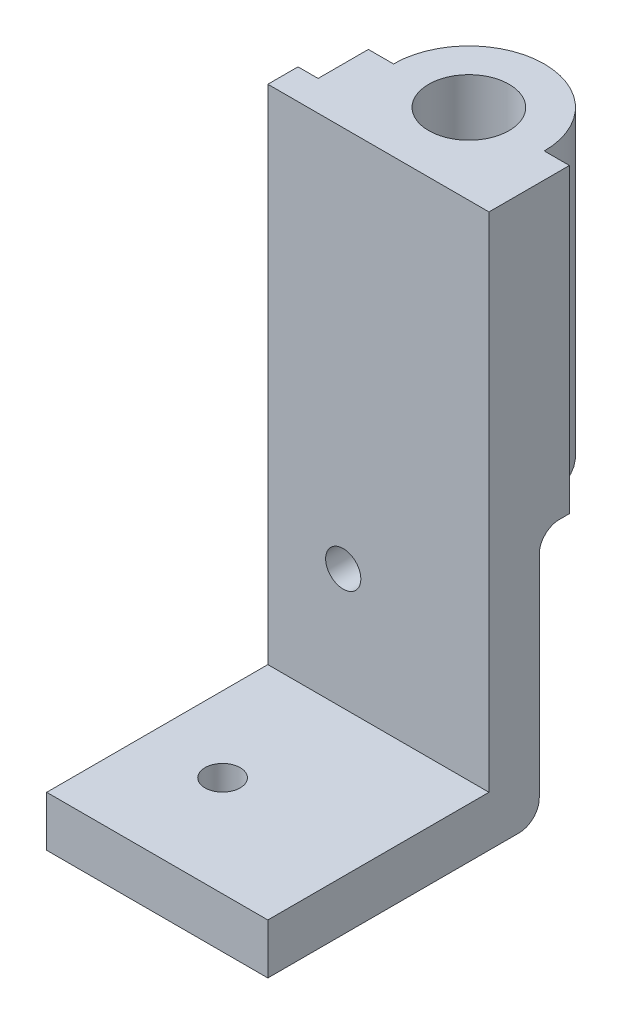
ISO-10303-21;
HEADER;
FILE_DESCRIPTION(('STEP AP214'),'2;1');
FILE_NAME('part.step','',(''),(''),'','','');
FILE_SCHEMA(('AUTOMOTIVE_DESIGN { 1 0 10303 214 1 1 1 1 }'));
ENDSEC;
DATA;
#1=APPLICATION_CONTEXT('core data for automotive mechanical design processes');
#2=APPLICATION_PROTOCOL_DEFINITION('international standard','automotive_design',2000,#1);
#3=PRODUCT_CONTEXT('',#1,'mechanical');
#4=PRODUCT('Part','Part','',(#3));
#5=PRODUCT_RELATED_PRODUCT_CATEGORY('part','',(#4));
#6=PRODUCT_DEFINITION_FORMATION('','',#4);
#7=PRODUCT_DEFINITION_CONTEXT('part definition',#1,'design');
#8=PRODUCT_DEFINITION('design','',#6,#7);
#9=PRODUCT_DEFINITION_SHAPE('','',#8);
#10=(LENGTH_UNIT() NAMED_UNIT(*) SI_UNIT(.MILLI.,.METRE.));
#11=(NAMED_UNIT(*) PLANE_ANGLE_UNIT() SI_UNIT($,.RADIAN.));
#12=(NAMED_UNIT(*) SI_UNIT($,.STERADIAN.) SOLID_ANGLE_UNIT());
#13=UNCERTAINTY_MEASURE_WITH_UNIT(LENGTH_MEASURE(1.E-05),#10,'distance_accuracy_value','');
#14=(GEOMETRIC_REPRESENTATION_CONTEXT(3) GLOBAL_UNCERTAINTY_ASSIGNED_CONTEXT((#13)) GLOBAL_UNIT_ASSIGNED_CONTEXT((#10,
#11,#12)) REPRESENTATION_CONTEXT('',''));
#15=CARTESIAN_POINT('',(0.,0.,0.));
#16=DIRECTION('',(0.,0.,1.));
#17=DIRECTION('',(1.,0.,0.));
#18=AXIS2_PLACEMENT_3D('',#15,#16,#17);
#19=CARTESIAN_POINT('',(0.,0.,0.));
#20=DIRECTION('',(0.,0.,-1.));
#21=DIRECTION('',(-1.,0.,0.));
#22=AXIS2_PLACEMENT_3D('',#19,#20,#21);
#23=PLANE('',#22);
#24=DIRECTION('',(0.,1.,0.));
#25=VECTOR('',#24,1.);
#26=CARTESIAN_POINT('',(2.,53.,0.));
#27=LINE('',#26,#25);
#28=CARTESIAN_POINT('',(2.,23.,0.));
#29=VERTEX_POINT('',#28);
#30=CARTESIAN_POINT('',(2.,53.,0.));
#31=VERTEX_POINT('',#30);
#32=EDGE_CURVE('E211',#29,#31,#27,.T.);
#33=ORIENTED_EDGE('',*,*,#32,.F.);
#34=DIRECTION('',(1.,0.,0.));
#35=VECTOR('',#34,1.);
#36=CARTESIAN_POINT('',(0.,23.,0.));
#37=LINE('',#36,#35);
#38=CARTESIAN_POINT('',(0.,23.,0.));
#39=VERTEX_POINT('',#38);
#40=EDGE_CURVE('E175',#39,#29,#37,.T.);
#41=ORIENTED_EDGE('',*,*,#40,.F.);
#42=DIRECTION('',(0.,-1.,0.));
#43=VECTOR('',#42,1.);
#44=CARTESIAN_POINT('',(0.,0.,0.));
#45=LINE('',#44,#43);
#46=CARTESIAN_POINT('',(0.,53.,0.));
#47=VERTEX_POINT('',#46);
#48=EDGE_CURVE('E171',#47,#39,#45,.T.);
#49=ORIENTED_EDGE('',*,*,#48,.F.);
#50=DIRECTION('',(-1.,0.,0.));
#51=VECTOR('',#50,1.);
#52=CARTESIAN_POINT('',(0.,53.,0.));
#53=LINE('',#52,#51);
#54=EDGE_CURVE('E257',#31,#47,#53,.T.);
#55=ORIENTED_EDGE('',*,*,#54,.F.);
#56=EDGE_LOOP('',(#33,#41,#49,#55));
#57=FACE_BOUND('',#56,.T.);
#58=ADVANCED_FACE('F45',(#57),#23,.T.);
#59=CARTESIAN_POINT('',(0.,0.,-5.));
#60=DIRECTION('',(0.,0.,1.));
#61=DIRECTION('',(1.,0.,0.));
#62=AXIS2_PLACEMENT_3D('',#59,#60,#61);
#63=PLANE('',#62);
#64=DIRECTION('',(1.,0.,0.));
#65=VECTOR('',#64,1.);
#66=CARTESIAN_POINT('',(2.,53.,-5.));
#67=LINE('',#66,#65);
#68=CARTESIAN_POINT('',(2.,53.,-5.));
#69=VERTEX_POINT('',#68);
#70=CARTESIAN_POINT('',(4.50000000000001,53.,-5.));
#71=VERTEX_POINT('',#70);
#72=EDGE_CURVE('E218',#69,#71,#67,.T.);
#73=ORIENTED_EDGE('',*,*,#72,.T.);
#74=DIRECTION('',(0.,-1.,0.));
#75=VECTOR('',#74,1.);
#76=CARTESIAN_POINT('',(4.50000000000001,53.,-5.));
#77=LINE('',#76,#75);
#78=CARTESIAN_POINT('',(4.5,23.,-5.));
#79=VERTEX_POINT('',#78);
#80=EDGE_CURVE('E208',#71,#79,#77,.T.);
#81=ORIENTED_EDGE('',*,*,#80,.T.);
#82=DIRECTION('',(-1.,0.,0.));
#83=VECTOR('',#82,1.);
#84=CARTESIAN_POINT('',(2.,23.,-5.));
#85=LINE('',#84,#83);
#86=CARTESIAN_POINT('',(2.,23.,-5.));
#87=VERTEX_POINT('',#86);
#88=EDGE_CURVE('E222',#79,#87,#85,.T.);
#89=ORIENTED_EDGE('',*,*,#88,.T.);
#90=DIRECTION('',(0.,1.,0.));
#91=VECTOR('',#90,1.);
#92=CARTESIAN_POINT('',(2.,53.,-5.));
#93=LINE('',#92,#91);
#94=EDGE_CURVE('E214',#87,#69,#93,.T.);
#95=ORIENTED_EDGE('',*,*,#94,.T.);
#96=EDGE_LOOP('',(#73,#81,#89,#95));
#97=FACE_BOUND('',#96,.T.);
#98=ADVANCED_FACE('F328',(#97),#63,.F.);
#99=CARTESIAN_POINT('',(0.,0.,3.));
#100=DIRECTION('',(0.,0.,-1.));
#101=DIRECTION('',(-1.,0.,0.));
#102=AXIS2_PLACEMENT_3D('',#99,#100,#101);
#103=PLANE('',#102);
#104=CARTESIAN_POINT('',(7.5,15.,3.));
#105=DIRECTION('',(0.,0.,-1.));
#106=DIRECTION('',(-1.,0.,0.));
#107=AXIS2_PLACEMENT_3D('',#104,#105,#106);
#108=CIRCLE('',#107,1.75);
#109=CARTESIAN_POINT('',(5.75,15.,3.));
#110=VERTEX_POINT('',#109);
#111=EDGE_CURVE('E234',#110,#110,#108,.T.);
#112=ORIENTED_EDGE('',*,*,#111,.T.);
#113=EDGE_LOOP('',(#112));
#114=FACE_BOUND('',#113,.T.);
#115=DIRECTION('',(-1.,0.,0.));
#116=VECTOR('',#115,1.);
#117=CARTESIAN_POINT('',(22.,3.,3.));
#118=LINE('',#117,#116);
#119=CARTESIAN_POINT('',(22.,3.,3.));
#120=VERTEX_POINT('',#119);
#121=CARTESIAN_POINT('',(0.,3.,3.));
#122=VERTEX_POINT('',#121);
#123=EDGE_CURVE('E242',#120,#122,#118,.T.);
#124=ORIENTED_EDGE('',*,*,#123,.F.);
#125=DIRECTION('',(0.,1.,0.));
#126=VECTOR('',#125,1.);
#127=CARTESIAN_POINT('',(22.,0.,3.));
#128=LINE('',#127,#126);
#129=CARTESIAN_POINT('',(22.,53.,3.));
#130=VERTEX_POINT('',#129);
#131=EDGE_CURVE('E256',#120,#130,#128,.T.);
#132=ORIENTED_EDGE('',*,*,#131,.T.);
#133=DIRECTION('',(-1.,0.,0.));
#134=VECTOR('',#133,1.);
#135=CARTESIAN_POINT('',(0.,53.,3.));
#136=LINE('',#135,#134);
#137=CARTESIAN_POINT('',(0.,53.,3.));
#138=VERTEX_POINT('',#137);
#139=EDGE_CURVE('E259',#130,#138,#136,.T.);
#140=ORIENTED_EDGE('',*,*,#139,.T.);
#141=DIRECTION('',(0.,-1.,0.));
#142=VECTOR('',#141,1.);
#143=CARTESIAN_POINT('',(0.,0.,3.));
#144=LINE('',#143,#142);
#145=EDGE_CURVE('E254',#138,#122,#144,.T.);
#146=ORIENTED_EDGE('',*,*,#145,.T.);
#147=EDGE_LOOP('',(#124,#132,#140,#146));
#148=FACE_BOUND('',#147,.T.);
#149=ADVANCED_FACE('F315',(#114,#148),#103,.F.);
#150=CARTESIAN_POINT('',(0.,0.,3.));
#151=DIRECTION('',(1.,0.,0.));
#152=DIRECTION('',(0.,0.,-1.));
#153=AXIS2_PLACEMENT_3D('',#150,#151,#152);
#154=PLANE('',#153);
#155=DIRECTION('',(0.,1.,0.));
#156=VECTOR('',#155,1.);
#157=CARTESIAN_POINT('',(0.,-2.,-2.));
#158=LINE('',#157,#156);
#159=CARTESIAN_POINT('',(0.,0.,-2.));
#160=VERTEX_POINT('',#159);
#161=CARTESIAN_POINT('',(0.,23.,-2.));
#162=VERTEX_POINT('',#161);
#163=EDGE_CURVE('E153',#160,#162,#158,.T.);
#164=ORIENTED_EDGE('',*,*,#163,.F.);
#165=CARTESIAN_POINT('',(0.,0.,0.));
#166=DIRECTION('',(1.,0.,0.));
#167=DIRECTION('',(0.,0.,-1.));
#168=AXIS2_PLACEMENT_3D('',#165,#166,#167);
#169=CIRCLE('',#168,2.);
#170=CARTESIAN_POINT('',(0.,-2.,0.));
#171=VERTEX_POINT('',#170);
#172=EDGE_CURVE('E271',#160,#171,#169,.F.);
#173=ORIENTED_EDGE('',*,*,#172,.T.);
#174=DIRECTION('',(0.,0.,-1.));
#175=VECTOR('',#174,1.);
#176=CARTESIAN_POINT('',(0.,-2.,25.));
#177=LINE('',#176,#175);
#178=CARTESIAN_POINT('',(0.,-2.,25.));
#179=VERTEX_POINT('',#178);
#180=EDGE_CURVE('E187',#179,#171,#177,.T.);
#181=ORIENTED_EDGE('',*,*,#180,.F.);
#182=DIRECTION('',(0.,-1.,0.));
#183=VECTOR('',#182,1.);
#184=CARTESIAN_POINT('',(0.,0.,25.));
#185=LINE('',#184,#183);
#186=CARTESIAN_POINT('',(0.,3.,25.));
#187=VERTEX_POINT('',#186);
#188=EDGE_CURVE('E244',#187,#179,#185,.T.);
#189=ORIENTED_EDGE('',*,*,#188,.F.);
#190=DIRECTION('',(0.,0.,-1.));
#191=VECTOR('',#190,1.);
#192=CARTESIAN_POINT('',(0.,3.,25.));
#193=LINE('',#192,#191);
#194=EDGE_CURVE('E246',#187,#122,#193,.T.);
#195=ORIENTED_EDGE('',*,*,#194,.T.);
#196=ORIENTED_EDGE('',*,*,#145,.F.);
#197=DIRECTION('',(0.,0.,-1.));
#198=VECTOR('',#197,1.);
#199=CARTESIAN_POINT('',(0.,53.,3.));
#200=LINE('',#199,#198);
#201=EDGE_CURVE('E261',#138,#47,#200,.T.);
#202=ORIENTED_EDGE('',*,*,#201,.T.);
#203=ORIENTED_EDGE('',*,*,#48,.T.);
#204=DIRECTION('',(0.,0.,1.));
#205=VECTOR('',#204,1.);
#206=CARTESIAN_POINT('',(0.,23.,-1.));
#207=LINE('',#206,#205);
#208=EDGE_CURVE('E167',#162,#39,#207,.T.);
#209=ORIENTED_EDGE('',*,*,#208,.F.);
#210=EDGE_LOOP('',(#164,#173,#181,#189,#195,#196,#202,#203,#209));
#211=FACE_BOUND('',#210,.T.);
#212=ADVANCED_FACE('F168',(#211),#154,.F.);
#213=CARTESIAN_POINT('',(22.,0.,3.));
#214=DIRECTION('',(-1.,0.,0.));
#215=DIRECTION('',(0.,0.,1.));
#216=AXIS2_PLACEMENT_3D('',#213,#214,#215);
#217=PLANE('',#216);
#218=DIRECTION('',(0.,0.,1.));
#219=VECTOR('',#218,1.);
#220=CARTESIAN_POINT('',(22.,-2.,25.));
#221=LINE('',#220,#219);
#222=CARTESIAN_POINT('',(22.,-2.,0.));
#223=VERTEX_POINT('',#222);
#224=CARTESIAN_POINT('',(22.,-2.,25.));
#225=VERTEX_POINT('',#224);
#226=EDGE_CURVE('E190',#223,#225,#221,.T.);
#227=ORIENTED_EDGE('',*,*,#226,.F.);
#228=CARTESIAN_POINT('',(22.,0.,0.));
#229=DIRECTION('',(-1.,0.,0.));
#230=DIRECTION('',(0.,0.,1.));
#231=AXIS2_PLACEMENT_3D('',#228,#229,#230);
#232=CIRCLE('',#231,2.);
#233=CARTESIAN_POINT('',(22.,0.,-2.));
#234=VERTEX_POINT('',#233);
#235=EDGE_CURVE('E275',#223,#234,#232,.F.);
#236=ORIENTED_EDGE('',*,*,#235,.T.);
#237=DIRECTION('',(0.,-1.,0.));
#238=VECTOR('',#237,1.);
#239=CARTESIAN_POINT('',(22.,-2.,-2.));
#240=LINE('',#239,#238);
#241=CARTESIAN_POINT('',(22.,21.,-2.));
#242=VERTEX_POINT('',#241);
#243=EDGE_CURVE('E179',#242,#234,#240,.T.);
#244=ORIENTED_EDGE('',*,*,#243,.F.);
#245=CARTESIAN_POINT('',(22.,21.,-4.));
#246=DIRECTION('',(-1.,0.,0.));
#247=DIRECTION('',(0.,0.,1.));
#248=AXIS2_PLACEMENT_3D('',#245,#246,#247);
#249=CIRCLE('',#248,2.);
#250=CARTESIAN_POINT('',(22.,23.,-4.));
#251=VERTEX_POINT('',#250);
#252=EDGE_CURVE('E53',#242,#251,#249,.T.);
#253=ORIENTED_EDGE('',*,*,#252,.T.);
#254=DIRECTION('',(0.,0.,1.));
#255=VECTOR('',#254,1.);
#256=CARTESIAN_POINT('',(22.,23.,-5.));
#257=LINE('',#256,#255);
#258=CARTESIAN_POINT('',(22.,23.,-5.));
#259=VERTEX_POINT('',#258);
#260=EDGE_CURVE('E229',#259,#251,#257,.T.);
#261=ORIENTED_EDGE('',*,*,#260,.F.);
#262=DIRECTION('',(0.,-1.,0.));
#263=VECTOR('',#262,1.);
#264=CARTESIAN_POINT('',(22.,53.,-5.));
#265=LINE('',#264,#263);
#266=CARTESIAN_POINT('',(22.,53.,-5.));
#267=VERTEX_POINT('',#266);
#268=EDGE_CURVE('E220',#267,#259,#265,.T.);
#269=ORIENTED_EDGE('',*,*,#268,.F.);
#270=DIRECTION('',(0.,0.,-1.));
#271=VECTOR('',#270,1.);
#272=CARTESIAN_POINT('',(22.,53.,3.));
#273=LINE('',#272,#271);
#274=EDGE_CURVE('E265',#130,#267,#273,.T.);
#275=ORIENTED_EDGE('',*,*,#274,.F.);
#276=ORIENTED_EDGE('',*,*,#131,.F.);
#277=DIRECTION('',(0.,0.,-1.));
#278=VECTOR('',#277,1.);
#279=CARTESIAN_POINT('',(22.,3.,25.));
#280=LINE('',#279,#278);
#281=CARTESIAN_POINT('',(22.,3.,25.));
#282=VERTEX_POINT('',#281);
#283=EDGE_CURVE('E251',#282,#120,#280,.T.);
#284=ORIENTED_EDGE('',*,*,#283,.F.);
#285=DIRECTION('',(0.,1.,0.));
#286=VECTOR('',#285,1.);
#287=CARTESIAN_POINT('',(22.,0.,25.));
#288=LINE('',#287,#286);
#289=EDGE_CURVE('E238',#225,#282,#288,.T.);
#290=ORIENTED_EDGE('',*,*,#289,.F.);
#291=EDGE_LOOP('',(#227,#236,#244,#253,#261,#269,#275,#276,#284,#290));
#292=FACE_BOUND('',#291,.T.);
#293=ADVANCED_FACE('F286',(#292),#217,.F.);
#294=CARTESIAN_POINT('',(0.,53.,3.));
#295=DIRECTION('',(0.,-1.,0.));
#296=DIRECTION('',(0.,0.,-1.));
#297=AXIS2_PLACEMENT_3D('',#294,#295,#296);
#298=PLANE('',#297);
#299=CARTESIAN_POINT('',(12.,53.,-5.));
#300=DIRECTION('',(0.,1.,0.));
#301=DIRECTION('',(0.,0.,1.));
#302=AXIS2_PLACEMENT_3D('',#299,#300,#301);
#303=CIRCLE('',#302,4.);
#304=CARTESIAN_POINT('',(12.,53.,-1.));
#305=VERTEX_POINT('',#304);
#306=EDGE_CURVE('E174',#305,#305,#303,.T.);
#307=ORIENTED_EDGE('',*,*,#306,.F.);
#308=EDGE_LOOP('',(#307));
#309=FACE_BOUND('',#308,.T.);
#310=ORIENTED_EDGE('',*,*,#274,.T.);
#311=CARTESIAN_POINT('',(19.5,53.,-5.));
#312=VERTEX_POINT('',#311);
#313=EDGE_CURVE('E217',#312,#267,#67,.T.);
#314=ORIENTED_EDGE('',*,*,#313,.F.);
#315=CARTESIAN_POINT('',(12.,53.,-5.));
#316=DIRECTION('',(0.,-1.,0.));
#317=DIRECTION('',(1.,0.,0.));
#318=AXIS2_PLACEMENT_3D('',#315,#316,#317);
#319=CIRCLE('',#318,7.5);
#320=EDGE_CURVE('E202',#71,#312,#319,.T.);
#321=ORIENTED_EDGE('',*,*,#320,.F.);
#322=ORIENTED_EDGE('',*,*,#72,.F.);
#323=DIRECTION('',(0.,0.,1.));
#324=VECTOR('',#323,1.);
#325=CARTESIAN_POINT('',(2.,53.,-5.));
#326=LINE('',#325,#324);
#327=EDGE_CURVE('E231',#69,#31,#326,.T.);
#328=ORIENTED_EDGE('',*,*,#327,.T.);
#329=ORIENTED_EDGE('',*,*,#54,.T.);
#330=ORIENTED_EDGE('',*,*,#201,.F.);
#331=ORIENTED_EDGE('',*,*,#139,.F.);
#332=EDGE_LOOP('',(#310,#314,#321,#322,#328,#329,#330,#331));
#333=FACE_BOUND('',#332,.T.);
#334=ADVANCED_FACE('F321',(#309,#333),#298,.F.);
#335=CARTESIAN_POINT('',(22.,3.,25.));
#336=DIRECTION('',(0.,-1.,0.));
#337=DIRECTION('',(1.,0.,0.));
#338=AXIS2_PLACEMENT_3D('',#335,#336,#337);
#339=PLANE('',#338);
#340=CARTESIAN_POINT('',(7.5,3.,15.));
#341=DIRECTION('',(0.,-1.,0.));
#342=DIRECTION('',(1.,0.,0.));
#343=AXIS2_PLACEMENT_3D('',#340,#341,#342);
#344=CIRCLE('',#343,1.75);
#345=CARTESIAN_POINT('',(9.25,3.,15.));
#346=VERTEX_POINT('',#345);
#347=EDGE_CURVE('E237',#346,#346,#344,.T.);
#348=ORIENTED_EDGE('',*,*,#347,.T.);
#349=EDGE_LOOP('',(#348));
#350=FACE_BOUND('',#349,.T.);
#351=ORIENTED_EDGE('',*,*,#123,.T.);
#352=ORIENTED_EDGE('',*,*,#194,.F.);
#353=DIRECTION('',(-1.,0.,0.));
#354=VECTOR('',#353,1.);
#355=CARTESIAN_POINT('',(22.,3.,25.));
#356=LINE('',#355,#354);
#357=EDGE_CURVE('E241',#282,#187,#356,.T.);
#358=ORIENTED_EDGE('',*,*,#357,.F.);
#359=ORIENTED_EDGE('',*,*,#283,.T.);
#360=EDGE_LOOP('',(#351,#352,#358,#359));
#361=FACE_BOUND('',#360,.T.);
#362=ADVANCED_FACE('F312',(#350,#361),#339,.F.);
#363=CARTESIAN_POINT('',(0.,0.,25.));
#364=DIRECTION('',(0.,0.,1.));
#365=DIRECTION('',(1.,0.,0.));
#366=AXIS2_PLACEMENT_3D('',#363,#364,#365);
#367=PLANE('',#366);
#368=ORIENTED_EDGE('',*,*,#289,.T.);
#369=ORIENTED_EDGE('',*,*,#357,.T.);
#370=ORIENTED_EDGE('',*,*,#188,.T.);
#371=DIRECTION('',(-1.,0.,0.));
#372=VECTOR('',#371,1.);
#373=CARTESIAN_POINT('',(0.,-2.,25.));
#374=LINE('',#373,#372);
#375=EDGE_CURVE('E192',#225,#179,#374,.T.);
#376=ORIENTED_EDGE('',*,*,#375,.F.);
#377=EDGE_LOOP('',(#368,#369,#370,#376));
#378=FACE_BOUND('',#377,.T.);
#379=ADVANCED_FACE('F307',(#378),#367,.T.);
#380=CARTESIAN_POINT('',(7.5,22.,15.));
#381=DIRECTION('',(0.,-1.,0.));
#382=DIRECTION('',(0.,0.,-1.));
#383=AXIS2_PLACEMENT_3D('',#380,#381,#382);
#384=CYLINDRICAL_SURFACE('',#383,1.75);
#385=ORIENTED_EDGE('',*,*,#347,.F.);
#386=EDGE_LOOP('',(#385));
#387=FACE_BOUND('',#386,.T.);
#388=CARTESIAN_POINT('',(7.5,-2.,15.));
#389=DIRECTION('',(0.,-1.,0.));
#390=DIRECTION('',(0.,0.,-1.));
#391=AXIS2_PLACEMENT_3D('',#388,#389,#390);
#392=CIRCLE('',#391,1.75);
#393=CARTESIAN_POINT('',(7.5,-2.,13.25));
#394=VERTEX_POINT('',#393);
#395=EDGE_CURVE('E181',#394,#394,#392,.T.);
#396=ORIENTED_EDGE('',*,*,#395,.T.);
#397=EDGE_LOOP('',(#396));
#398=FACE_BOUND('',#397,.T.);
#399=ADVANCED_FACE('F411',(#387,#398),#384,.F.);
#400=CARTESIAN_POINT('',(7.5,15.,25.));
#401=DIRECTION('',(0.,0.,-1.));
#402=DIRECTION('',(-1.,0.,0.));
#403=AXIS2_PLACEMENT_3D('',#400,#401,#402);
#404=CYLINDRICAL_SURFACE('',#403,1.75);
#405=CARTESIAN_POINT('',(7.5,15.,-2.));
#406=DIRECTION('',(0.,0.,-1.));
#407=DIRECTION('',(-1.,0.,0.));
#408=AXIS2_PLACEMENT_3D('',#405,#406,#407);
#409=CIRCLE('',#408,1.75);
#410=CARTESIAN_POINT('',(5.75,15.,-2.));
#411=VERTEX_POINT('',#410);
#412=EDGE_CURVE('E163',#411,#411,#409,.T.);
#413=CARTESIAN_POINT('',(5.75,15.,3.));
#414=CARTESIAN_POINT('',(5.75,15.,2.94791666666667));
#415=CARTESIAN_POINT('',(5.75,15.,2.89583333333334));
#416=CARTESIAN_POINT('',(5.75,15.,2.79166666666667));
#417=CARTESIAN_POINT('',(5.75,15.,2.73958333333334));
#418=CARTESIAN_POINT('',(5.75,15.,2.63541666666667));
#419=CARTESIAN_POINT('',(5.75,15.,2.58333333333334));
#420=CARTESIAN_POINT('',(5.75,15.,2.47916666666667));
#421=CARTESIAN_POINT('',(5.75,15.,2.42708333333334));
#422=CARTESIAN_POINT('',(5.75,15.,2.32291666666667));
#423=CARTESIAN_POINT('',(5.75,15.,2.27083333333334));
#424=CARTESIAN_POINT('',(5.75,15.,2.16666666666667));
#425=CARTESIAN_POINT('',(5.75,15.,2.11458333333334));
#426=CARTESIAN_POINT('',(5.75,15.,2.01041666666667));
#427=CARTESIAN_POINT('',(5.75,15.,1.95833333333334));
#428=CARTESIAN_POINT('',(5.75,15.,1.85416666666667));
#429=CARTESIAN_POINT('',(5.75,15.,1.80208333333334));
#430=CARTESIAN_POINT('',(5.75,15.,1.69791666666667));
#431=CARTESIAN_POINT('',(5.75,15.,1.64583333333333));
#432=CARTESIAN_POINT('',(5.75,15.,1.54166666666667));
#433=CARTESIAN_POINT('',(5.75,15.,1.48958333333333));
#434=CARTESIAN_POINT('',(5.75,15.,1.38541666666667));
#435=CARTESIAN_POINT('',(5.75,15.,1.33333333333333));
#436=CARTESIAN_POINT('',(5.75,15.,1.22916666666667));
#437=CARTESIAN_POINT('',(5.75,15.,1.17708333333333));
#438=CARTESIAN_POINT('',(5.75,15.,1.07291666666667));
#439=CARTESIAN_POINT('',(5.75,15.,1.02083333333333));
#440=CARTESIAN_POINT('',(5.75,15.,0.916666666666668));
#441=CARTESIAN_POINT('',(5.75,15.,0.864583333333334));
#442=CARTESIAN_POINT('',(5.75,15.,0.760416666666667));
#443=CARTESIAN_POINT('',(5.75,15.,0.708333333333334));
#444=CARTESIAN_POINT('',(5.75,15.,0.604166666666667));
#445=CARTESIAN_POINT('',(5.75,15.,0.552083333333334));
#446=CARTESIAN_POINT('',(5.75,15.,0.447916666666667));
#447=CARTESIAN_POINT('',(5.75,15.,0.395833333333334));
#448=CARTESIAN_POINT('',(5.75,15.,0.291666666666667));
#449=CARTESIAN_POINT('',(5.75,15.,0.239583333333334));
#450=CARTESIAN_POINT('',(5.75,15.,0.135416666666667));
#451=CARTESIAN_POINT('',(5.75,15.,0.0833333333333334));
#452=CARTESIAN_POINT('',(5.75,15.,-0.0208333333333333));
#453=CARTESIAN_POINT('',(5.75,15.,-0.0729166666666667));
#454=CARTESIAN_POINT('',(5.75,15.,-0.177083333333333));
#455=CARTESIAN_POINT('',(5.75,15.,-0.229166666666667));
#456=CARTESIAN_POINT('',(5.75,15.,-0.333333333333334));
#457=CARTESIAN_POINT('',(5.75,15.,-0.385416666666667));
#458=CARTESIAN_POINT('',(5.75,15.,-0.489583333333334));
#459=CARTESIAN_POINT('',(5.75,15.,-0.541666666666667));
#460=CARTESIAN_POINT('',(5.75,15.,-0.645833333333334));
#461=CARTESIAN_POINT('',(5.75,15.,-0.697916666666667));
#462=CARTESIAN_POINT('',(5.75,15.,-0.802083333333334));
#463=CARTESIAN_POINT('',(5.75,15.,-0.854166666666667));
#464=CARTESIAN_POINT('',(5.75,15.,-0.958333333333334));
#465=CARTESIAN_POINT('',(5.75,15.,-1.01041666666667));
#466=CARTESIAN_POINT('',(5.75,15.,-1.11458333333333));
#467=CARTESIAN_POINT('',(5.75,15.,-1.16666666666667));
#468=CARTESIAN_POINT('',(5.75,15.,-1.27083333333333));
#469=CARTESIAN_POINT('',(5.75,15.,-1.32291666666667));
#470=CARTESIAN_POINT('',(5.75,15.,-1.42708333333333));
#471=CARTESIAN_POINT('',(5.75,15.,-1.47916666666667));
#472=CARTESIAN_POINT('',(5.75,15.,-1.58333333333333));
#473=CARTESIAN_POINT('',(5.75,15.,-1.63541666666667));
#474=CARTESIAN_POINT('',(5.75,15.,-1.73958333333334));
#475=CARTESIAN_POINT('',(5.75,15.,-1.79166666666667));
#476=CARTESIAN_POINT('',(5.75,15.,-1.89583333333334));
#477=CARTESIAN_POINT('',(5.75,15.,-1.94791666666667));
#478=CARTESIAN_POINT('',(5.75,15.,-2.));
#479=B_SPLINE_CURVE_WITH_KNOTS('',3,(#413,#414,#415,#416,#417,#418,#419,#420,#421,#422,#423,
#424,#425,#426,#427,#428,#429,#430,#431,#432,#433,#434,#435,#436,#437,#438,#439,#440,#441,#442,
#443,#444,#445,#446,#447,#448,#449,#450,#451,#452,#453,#454,#455,#456,#457,#458,#459,#460,#461,
#462,#463,#464,#465,#466,#467,#468,#469,#470,#471,#472,#473,#474,#475,#476,#477,#478),
.UNSPECIFIED.,.F.,.F.,(4,2,2,2,2,2,2,2,2,2,2,2,2,2,2,2,2,2,2,2,2,2,2,2,2,2,2,2,2,2,2,2,4),(0.,
0.15625,0.3125,0.46875,0.625000000000001,0.781250000000001,0.937500000000001,1.09375,1.25,
1.40625,1.5625,1.71875,1.875,2.03125,2.1875,2.34375,2.5,2.65625,2.8125,2.96875,3.125,3.28125,
3.4375,3.59375,3.75,3.90625,4.0625,4.21875,4.375,4.53125,4.6875,4.84375,5.),.UNSPECIFIED.);
#480=EDGE_CURVE('BSEAM418',#110,#411,#479,.T.);
#481=ORIENTED_EDGE('',*,*,#111,.F.);
#482=ORIENTED_EDGE('',*,*,#412,.T.);
#483=ORIENTED_EDGE('',*,*,#480,.T.);
#484=ORIENTED_EDGE('',*,*,#480,.F.);
#485=EDGE_LOOP('',(#481,#483,#482,#484));
#486=FACE_BOUND('',#485,.T.);
#487=ADVANCED_FACE('F418',(#486),#404,.F.);
#488=CARTESIAN_POINT('',(2.,53.,-5.));
#489=DIRECTION('',(1.,0.,0.));
#490=DIRECTION('',(0.,1.,0.));
#491=AXIS2_PLACEMENT_3D('',#488,#489,#490);
#492=PLANE('',#491);
#493=ORIENTED_EDGE('',*,*,#32,.T.);
#494=ORIENTED_EDGE('',*,*,#327,.F.);
#495=ORIENTED_EDGE('',*,*,#94,.F.);
#496=DIRECTION('',(0.,0.,1.));
#497=VECTOR('',#496,1.);
#498=CARTESIAN_POINT('',(2.,23.,-5.));
#499=LINE('',#498,#497);
#500=CARTESIAN_POINT('',(2.,23.,-4.));
#501=VERTEX_POINT('',#500);
#502=EDGE_CURVE('E227',#87,#501,#499,.T.);
#503=ORIENTED_EDGE('',*,*,#502,.T.);
#504=CARTESIAN_POINT('',(2.,21.,-4.));
#505=DIRECTION('',(1.,0.,0.));
#506=DIRECTION('',(0.,1.,0.));
#507=AXIS2_PLACEMENT_3D('',#504,#505,#506);
#508=CIRCLE('',#507,2.);
#509=CARTESIAN_POINT('',(2.,21.,-2.));
#510=VERTEX_POINT('',#509);
#511=EDGE_CURVE('E13',#501,#510,#508,.T.);
#512=ORIENTED_EDGE('',*,*,#511,.T.);
#513=DIRECTION('',(0.,-1.,0.));
#514=VECTOR('',#513,1.);
#515=CARTESIAN_POINT('',(2.,0.,-2.));
#516=LINE('',#515,#514);
#517=CARTESIAN_POINT('',(2.,23.,-2.));
#518=VERTEX_POINT('',#517);
#519=EDGE_CURVE('E59',#518,#510,#516,.T.);
#520=ORIENTED_EDGE('',*,*,#519,.F.);
#521=EDGE_CURVE('E178',#518,#29,#499,.T.);
#522=ORIENTED_EDGE('',*,*,#521,.T.);
#523=EDGE_LOOP('',(#493,#494,#495,#503,#512,#520,#522));
#524=FACE_BOUND('',#523,.T.);
#525=ADVANCED_FACE('F293',(#524),#492,.F.);
#526=CARTESIAN_POINT('',(2.,23.,-5.));
#527=DIRECTION('',(0.,1.,0.));
#528=DIRECTION('',(-1.,0.,0.));
#529=AXIS2_PLACEMENT_3D('',#526,#527,#528);
#530=PLANE('',#529);
#531=ORIENTED_EDGE('',*,*,#260,.T.);
#532=DIRECTION('',(1.,0.,0.));
#533=VECTOR('',#532,1.);
#534=CARTESIAN_POINT('',(2.,23.,-4.));
#535=LINE('',#534,#533);
#536=EDGE_CURVE('E67',#251,#501,#535,.F.);
#537=ORIENTED_EDGE('',*,*,#536,.T.);
#538=ORIENTED_EDGE('',*,*,#502,.F.);
#539=ORIENTED_EDGE('',*,*,#88,.F.);
#540=CARTESIAN_POINT('',(12.,23.,-5.));
#541=DIRECTION('',(0.,-1.,0.));
#542=DIRECTION('',(1.,0.,0.));
#543=AXIS2_PLACEMENT_3D('',#540,#541,#542);
#544=CIRCLE('',#543,7.5);
#545=CARTESIAN_POINT('',(19.5,23.,-5.));
#546=VERTEX_POINT('',#545);
#547=EDGE_CURVE('E199',#79,#546,#544,.T.);
#548=ORIENTED_EDGE('',*,*,#547,.T.);
#549=EDGE_CURVE('E223',#259,#546,#85,.T.);
#550=ORIENTED_EDGE('',*,*,#549,.F.);
#551=EDGE_LOOP('',(#531,#537,#538,#539,#548,#550));
#552=FACE_BOUND('',#551,.T.);
#553=ADVANCED_FACE('F291',(#552),#530,.F.);
#554=ORIENTED_EDGE('',*,*,#549,.T.);
#555=DIRECTION('',(0.,-1.,0.));
#556=VECTOR('',#555,1.);
#557=CARTESIAN_POINT('',(19.5,53.,-5.));
#558=LINE('',#557,#556);
#559=EDGE_CURVE('E205',#312,#546,#558,.T.);
#560=ORIENTED_EDGE('',*,*,#559,.F.);
#561=ORIENTED_EDGE('',*,*,#313,.T.);
#562=ORIENTED_EDGE('',*,*,#268,.T.);
#563=EDGE_LOOP('',(#554,#560,#561,#562));
#564=FACE_BOUND('',#563,.T.);
#565=ADVANCED_FACE('F333',(#564),#63,.F.);
#566=CARTESIAN_POINT('',(12.,53.,-5.));
#567=DIRECTION('',(0.,-1.,0.));
#568=DIRECTION('',(1.,0.,0.));
#569=AXIS2_PLACEMENT_3D('',#566,#567,#568);
#570=CYLINDRICAL_SURFACE('',#569,7.5);
#571=ORIENTED_EDGE('',*,*,#547,.F.);
#572=ORIENTED_EDGE('',*,*,#80,.F.);
#573=ORIENTED_EDGE('',*,*,#320,.T.);
#574=ORIENTED_EDGE('',*,*,#559,.T.);
#575=EDGE_LOOP('',(#571,#572,#573,#574));
#576=FACE_BOUND('',#575,.T.);
#577=ADVANCED_FACE('F331',(#576),#570,.T.);
#578=CARTESIAN_POINT('',(12.,33.,-5.));
#579=DIRECTION('',(0.,1.,0.));
#580=DIRECTION('',(0.,0.,1.));
#581=AXIS2_PLACEMENT_3D('',#578,#579,#580);
#582=CYLINDRICAL_SURFACE('',#581,4.);
#583=CARTESIAN_POINT('',(12.,33.,-5.));
#584=DIRECTION('',(0.,1.,0.));
#585=DIRECTION('',(0.,0.,1.));
#586=AXIS2_PLACEMENT_3D('',#583,#584,#585);
#587=CIRCLE('',#586,4.);
#588=CARTESIAN_POINT('',(12.,33.,-1.));
#589=VERTEX_POINT('',#588);
#590=EDGE_CURVE('E196',#589,#589,#587,.T.);
#591=ORIENTED_EDGE('',*,*,#590,.F.);
#592=EDGE_LOOP('',(#591));
#593=FACE_BOUND('',#592,.T.);
#594=ORIENTED_EDGE('',*,*,#306,.T.);
#595=EDGE_LOOP('',(#594));
#596=FACE_BOUND('',#595,.T.);
#597=ADVANCED_FACE('F340',(#593,#596),#582,.F.);
#598=CARTESIAN_POINT('',(12.,33.,-5.));
#599=DIRECTION('',(0.,1.,0.));
#600=DIRECTION('',(0.,0.,1.));
#601=AXIS2_PLACEMENT_3D('',#598,#599,#600);
#602=PLANE('',#601);
#603=ORIENTED_EDGE('',*,*,#590,.T.);
#604=EDGE_LOOP('',(#603));
#605=FACE_BOUND('',#604,.T.);
#606=ADVANCED_FACE('F373',(#605),#602,.T.);
#607=CARTESIAN_POINT('',(0.,23.,-1.));
#608=DIRECTION('',(0.,-1.,0.));
#609=DIRECTION('',(0.,0.,-1.));
#610=AXIS2_PLACEMENT_3D('',#607,#608,#609);
#611=PLANE('',#610);
#612=ORIENTED_EDGE('',*,*,#40,.T.);
#613=ORIENTED_EDGE('',*,*,#521,.F.);
#614=DIRECTION('',(1.,0.,0.));
#615=VECTOR('',#614,1.);
#616=CARTESIAN_POINT('',(0.,23.,-2.));
#617=LINE('',#616,#615);
#618=EDGE_CURVE('E158',#162,#518,#617,.T.);
#619=ORIENTED_EDGE('',*,*,#618,.F.);
#620=ORIENTED_EDGE('',*,*,#208,.T.);
#621=EDGE_LOOP('',(#612,#613,#619,#620));
#622=FACE_BOUND('',#621,.T.);
#623=ADVANCED_FACE('F177',(#622),#611,.F.);
#624=CARTESIAN_POINT('',(0.,-2.,0.));
#625=DIRECTION('',(0.,-1.,0.));
#626=DIRECTION('',(0.,0.,-1.));
#627=AXIS2_PLACEMENT_3D('',#624,#625,#626);
#628=PLANE('',#627);
#629=ORIENTED_EDGE('',*,*,#180,.T.);
#630=DIRECTION('',(-1.,0.,0.));
#631=VECTOR('',#630,1.);
#632=CARTESIAN_POINT('',(0.,-2.,0.));
#633=LINE('',#632,#631);
#634=EDGE_CURVE('E273',#171,#223,#633,.F.);
#635=ORIENTED_EDGE('',*,*,#634,.T.);
#636=ORIENTED_EDGE('',*,*,#226,.T.);
#637=ORIENTED_EDGE('',*,*,#375,.T.);
#638=EDGE_LOOP('',(#629,#635,#636,#637));
#639=FACE_BOUND('',#638,.T.);
#640=ORIENTED_EDGE('',*,*,#395,.F.);
#641=EDGE_LOOP('',(#640));
#642=FACE_BOUND('',#641,.T.);
#643=ADVANCED_FACE('F303',(#639,#642),#628,.T.);
#644=CARTESIAN_POINT('',(0.,0.,-2.));
#645=DIRECTION('',(0.,0.,-1.));
#646=DIRECTION('',(-1.,0.,0.));
#647=AXIS2_PLACEMENT_3D('',#644,#645,#646);
#648=PLANE('',#647);
#649=ORIENTED_EDGE('',*,*,#519,.T.);
#650=DIRECTION('',(1.,0.,0.));
#651=VECTOR('',#650,1.);
#652=CARTESIAN_POINT('',(0.,21.,-2.));
#653=LINE('',#652,#651);
#654=EDGE_CURVE('E279',#510,#242,#653,.T.);
#655=ORIENTED_EDGE('',*,*,#654,.T.);
#656=ORIENTED_EDGE('',*,*,#243,.T.);
#657=DIRECTION('',(-1.,0.,0.));
#658=VECTOR('',#657,1.);
#659=CARTESIAN_POINT('',(0.,0.,-2.));
#660=LINE('',#659,#658);
#661=EDGE_CURVE('E161',#234,#160,#660,.T.);
#662=ORIENTED_EDGE('',*,*,#661,.T.);
#663=ORIENTED_EDGE('',*,*,#163,.T.);
#664=ORIENTED_EDGE('',*,*,#618,.T.);
#665=EDGE_LOOP('',(#649,#655,#656,#662,#663,#664));
#666=FACE_BOUND('',#665,.T.);
#667=ORIENTED_EDGE('',*,*,#412,.F.);
#668=EDGE_LOOP('',(#667));
#669=FACE_BOUND('',#668,.T.);
#670=ADVANCED_FACE('F155',(#666,#669),#648,.T.);
#671=CARTESIAN_POINT('',(0.,0.,0.));
#672=DIRECTION('',(-1.,0.,0.));
#673=DIRECTION('',(0.,0.,1.));
#674=AXIS2_PLACEMENT_3D('',#671,#672,#673);
#675=CYLINDRICAL_SURFACE('',#674,2.);
#676=ORIENTED_EDGE('',*,*,#235,.F.);
#677=ORIENTED_EDGE('',*,*,#634,.F.);
#678=ORIENTED_EDGE('',*,*,#172,.F.);
#679=ORIENTED_EDGE('',*,*,#661,.F.);
#680=EDGE_LOOP('',(#676,#677,#678,#679));
#681=FACE_BOUND('',#680,.T.);
#682=ADVANCED_FACE('F299',(#681),#675,.T.);
#683=CARTESIAN_POINT('',(0.,21.,-4.));
#684=DIRECTION('',(1.,0.,0.));
#685=DIRECTION('',(0.,1.,0.));
#686=AXIS2_PLACEMENT_3D('',#683,#684,#685);
#687=CYLINDRICAL_SURFACE('',#686,2.);
#688=ORIENTED_EDGE('',*,*,#511,.F.);
#689=ORIENTED_EDGE('',*,*,#536,.F.);
#690=ORIENTED_EDGE('',*,*,#252,.F.);
#691=ORIENTED_EDGE('',*,*,#654,.F.);
#692=EDGE_LOOP('',(#688,#689,#690,#691));
#693=FACE_BOUND('',#692,.T.);
#694=ADVANCED_FACE('F47',(#693),#687,.F.);
#695=CLOSED_SHELL('',(#58,#98,#149,#212,#293,#334,#362,#379,#399,#487,#525,#553,#565,#577,#597,
#606,#623,#643,#670,#682,#694));
#696=MANIFOLD_SOLID_BREP('B2',#695);
#697=ADVANCED_BREP_SHAPE_REPRESENTATION('',(#18,#696),#14);
#698=SHAPE_DEFINITION_REPRESENTATION(#9,#697);
ENDSEC;
END-ISO-10303-21;
